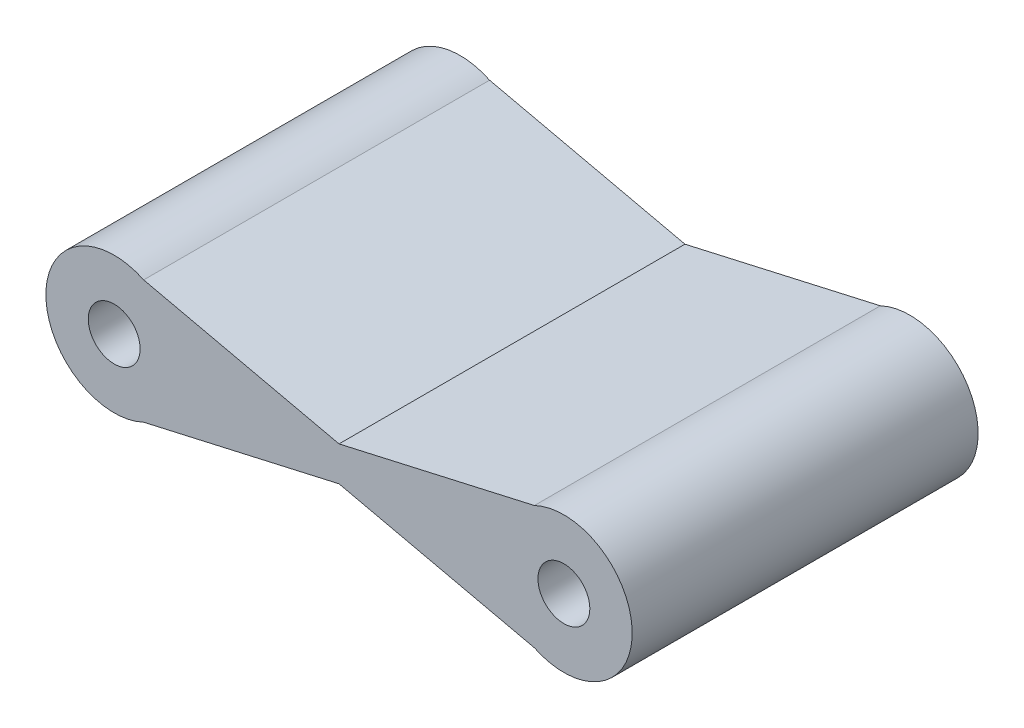
ISO-10303-21;
HEADER;
FILE_DESCRIPTION(('STEP AP214'),'2;1');
FILE_NAME('part.step','',(''),(''),'','','');
FILE_SCHEMA(('AUTOMOTIVE_DESIGN { 1 0 10303 214 1 1 1 1 }'));
ENDSEC;
DATA;
#1=APPLICATION_CONTEXT('core data for automotive mechanical design processes');
#2=APPLICATION_PROTOCOL_DEFINITION('international standard','automotive_design',2000,#1);
#3=PRODUCT_CONTEXT('',#1,'mechanical');
#4=PRODUCT('Part','Part','',(#3));
#5=PRODUCT_RELATED_PRODUCT_CATEGORY('part','',(#4));
#6=PRODUCT_DEFINITION_FORMATION('','',#4);
#7=PRODUCT_DEFINITION_CONTEXT('part definition',#1,'design');
#8=PRODUCT_DEFINITION('design','',#6,#7);
#9=PRODUCT_DEFINITION_SHAPE('','',#8);
#10=(LENGTH_UNIT() NAMED_UNIT(*) SI_UNIT(.MILLI.,.METRE.));
#11=(NAMED_UNIT(*) PLANE_ANGLE_UNIT() SI_UNIT($,.RADIAN.));
#12=(NAMED_UNIT(*) SI_UNIT($,.STERADIAN.) SOLID_ANGLE_UNIT());
#13=UNCERTAINTY_MEASURE_WITH_UNIT(LENGTH_MEASURE(1.E-05),#10,'distance_accuracy_value','');
#14=(GEOMETRIC_REPRESENTATION_CONTEXT(3) GLOBAL_UNCERTAINTY_ASSIGNED_CONTEXT((#13)) GLOBAL_UNIT_ASSIGNED_CONTEXT((#10,
#11,#12)) REPRESENTATION_CONTEXT('',''));
#15=CARTESIAN_POINT('',(0.,0.,0.));
#16=DIRECTION('',(0.,0.,1.));
#17=DIRECTION('',(1.,0.,0.));
#18=AXIS2_PLACEMENT_3D('',#15,#16,#17);
#19=CARTESIAN_POINT('',(0.318319944851648,1.40276585866828,10.));
#20=DIRECTION('',(-0.221296857654929,-0.975206491360704,0.));
#21=DIRECTION('',(0.975206491360704,-0.221296857654929,0.));
#22=AXIS2_PLACEMENT_3D('',#19,#20,#21);
#23=PLANE('',#22);
#24=DIRECTION('',(-0.975206491360704,0.221296857654929,0.));
#25=VECTOR('',#24,1.);
#26=CARTESIAN_POINT('',(0.318319944851648,1.40276585866828,0.));
#27=LINE('',#26,#25);
#28=CARTESIAN_POINT('',(12.1475499781939,-1.28155941812862,0.));
#29=VERTEX_POINT('',#28);
#30=CARTESIAN_POINT('',(6.5,0.,0.));
#31=VERTEX_POINT('',#30);
#32=EDGE_CURVE('E129',#29,#31,#27,.T.);
#33=ORIENTED_EDGE('',*,*,#32,.F.);
#34=DIRECTION('',(0.,0.,-1.));
#35=VECTOR('',#34,1.);
#36=CARTESIAN_POINT('',(12.1475499781939,-1.28155941812862,10.));
#37=LINE('',#36,#35);
#38=CARTESIAN_POINT('',(12.1475499781939,-1.28155941812862,10.));
#39=VERTEX_POINT('',#38);
#40=EDGE_CURVE('E11',#39,#29,#37,.T.);
#41=ORIENTED_EDGE('',*,*,#40,.F.);
#42=DIRECTION('',(-0.975206491360704,0.221296857654929,0.));
#43=VECTOR('',#42,1.);
#44=CARTESIAN_POINT('',(0.318319944851648,1.40276585866828,10.));
#45=LINE('',#44,#43);
#46=CARTESIAN_POINT('',(6.5,0.,10.));
#47=VERTEX_POINT('',#46);
#48=EDGE_CURVE('E189',#39,#47,#45,.T.);
#49=ORIENTED_EDGE('',*,*,#48,.T.);
#50=DIRECTION('',(0.,0.,-1.));
#51=VECTOR('',#50,1.);
#52=CARTESIAN_POINT('',(6.5,0.,10.));
#53=LINE('',#52,#51);
#54=EDGE_CURVE('E82',#47,#31,#53,.T.);
#55=ORIENTED_EDGE('',*,*,#54,.T.);
#56=EDGE_LOOP('',(#33,#41,#49,#55));
#57=FACE_BOUND('',#56,.T.);
#58=ADVANCED_FACE('F36',(#57),#23,.T.);
#59=CARTESIAN_POINT('',(13.,0.5,10.));
#60=DIRECTION('',(0.,0.,-1.));
#61=DIRECTION('',(-1.,0.,0.));
#62=AXIS2_PLACEMENT_3D('',#59,#60,#61);
#63=CYLINDRICAL_SURFACE('',#62,1.97499999999999);
#64=CARTESIAN_POINT('',(13.,0.5,0.));
#65=DIRECTION('',(0.,0.,1.));
#66=DIRECTION('',(1.,0.,0.));
#67=AXIS2_PLACEMENT_3D('',#64,#65,#66);
#68=CIRCLE('',#67,1.97499999999999);
#69=CARTESIAN_POINT('',(12.1475499781939,2.28155941812862,0.));
#70=VERTEX_POINT('',#69);
#71=EDGE_CURVE('E131',#29,#70,#68,.T.);
#72=ORIENTED_EDGE('',*,*,#71,.T.);
#73=DIRECTION('',(0.,0.,-1.));
#74=VECTOR('',#73,1.);
#75=CARTESIAN_POINT('',(12.1475499781939,2.28155941812862,10.));
#76=LINE('',#75,#74);
#77=CARTESIAN_POINT('',(12.1475499781939,2.28155941812862,10.));
#78=VERTEX_POINT('',#77);
#79=EDGE_CURVE('E45',#78,#70,#76,.T.);
#80=ORIENTED_EDGE('',*,*,#79,.F.);
#81=CARTESIAN_POINT('',(13.,0.5,10.));
#82=DIRECTION('',(0.,0.,1.));
#83=DIRECTION('',(1.,0.,0.));
#84=AXIS2_PLACEMENT_3D('',#81,#82,#83);
#85=CIRCLE('',#84,1.97499999999999);
#86=EDGE_CURVE('E118',#39,#78,#85,.T.);
#87=ORIENTED_EDGE('',*,*,#86,.F.);
#88=ORIENTED_EDGE('',*,*,#40,.T.);
#89=EDGE_LOOP('',(#72,#80,#87,#88));
#90=FACE_BOUND('',#89,.T.);
#91=ADVANCED_FACE('F153',(#90),#63,.T.);
#92=CARTESIAN_POINT('',(0.102509812748837,-0.45173815787623,10.));
#93=DIRECTION('',(-0.221296857654929,0.975206491360704,0.));
#94=DIRECTION('',(-0.975206491360704,-0.221296857654929,0.));
#95=AXIS2_PLACEMENT_3D('',#92,#93,#94);
#96=PLANE('',#95);
#97=DIRECTION('',(0.975206491360704,0.221296857654929,0.));
#98=VECTOR('',#97,1.);
#99=CARTESIAN_POINT('',(0.102509812748837,-0.45173815787623,0.));
#100=LINE('',#99,#98);
#101=CARTESIAN_POINT('',(6.5,0.999999999999999,0.));
#102=VERTEX_POINT('',#101);
#103=EDGE_CURVE('E134',#102,#70,#100,.T.);
#104=ORIENTED_EDGE('',*,*,#103,.F.);
#105=DIRECTION('',(0.,0.,-1.));
#106=VECTOR('',#105,1.);
#107=CARTESIAN_POINT('',(6.5,0.999999999999999,10.));
#108=LINE('',#107,#106);
#109=CARTESIAN_POINT('',(6.5,0.999999999999999,10.));
#110=VERTEX_POINT('',#109);
#111=EDGE_CURVE('E105',#110,#102,#108,.T.);
#112=ORIENTED_EDGE('',*,*,#111,.F.);
#113=DIRECTION('',(0.975206491360704,0.221296857654929,0.));
#114=VECTOR('',#113,1.);
#115=CARTESIAN_POINT('',(0.102509812748837,-0.45173815787623,10.));
#116=LINE('',#115,#114);
#117=EDGE_CURVE('E116',#110,#78,#116,.T.);
#118=ORIENTED_EDGE('',*,*,#117,.T.);
#119=ORIENTED_EDGE('',*,*,#79,.T.);
#120=EDGE_LOOP('',(#104,#112,#118,#119));
#121=FACE_BOUND('',#120,.T.);
#122=ADVANCED_FACE('F150',(#121),#96,.T.);
#123=CARTESIAN_POINT('',(0.534130076954461,2.35379355946033,10.));
#124=DIRECTION('',(0.221296857654929,0.975206491360704,0.));
#125=DIRECTION('',(-0.975206491360704,0.221296857654929,0.));
#126=AXIS2_PLACEMENT_3D('',#123,#124,#125);
#127=PLANE('',#126);
#128=DIRECTION('',(0.975206491360704,-0.221296857654929,0.));
#129=VECTOR('',#128,1.);
#130=CARTESIAN_POINT('',(0.534130076954461,2.35379355946033,0.));
#131=LINE('',#130,#129);
#132=CARTESIAN_POINT('',(0.852450021806109,2.28155941812861,0.));
#133=VERTEX_POINT('',#132);
#134=EDGE_CURVE('E102',#133,#102,#131,.T.);
#135=ORIENTED_EDGE('',*,*,#134,.F.);
#136=DIRECTION('',(0.,0.,-1.));
#137=VECTOR('',#136,1.);
#138=CARTESIAN_POINT('',(0.852450021806109,2.28155941812861,10.));
#139=LINE('',#138,#137);
#140=CARTESIAN_POINT('',(0.852450021806109,2.28155941812861,10.));
#141=VERTEX_POINT('',#140);
#142=EDGE_CURVE('E96',#141,#133,#139,.T.);
#143=ORIENTED_EDGE('',*,*,#142,.F.);
#144=DIRECTION('',(0.975206491360704,-0.221296857654929,0.));
#145=VECTOR('',#144,1.);
#146=CARTESIAN_POINT('',(0.534130076954461,2.35379355946033,10.));
#147=LINE('',#146,#145);
#148=EDGE_CURVE('E100',#141,#110,#147,.T.);
#149=ORIENTED_EDGE('',*,*,#148,.T.);
#150=ORIENTED_EDGE('',*,*,#111,.T.);
#151=EDGE_LOOP('',(#135,#143,#149,#150));
#152=FACE_BOUND('',#151,.T.);
#153=ADVANCED_FACE('F98',(#152),#127,.T.);
#154=CARTESIAN_POINT('',(0.,0.5,10.));
#155=DIRECTION('',(0.,0.,-1.));
#156=DIRECTION('',(-1.,0.,0.));
#157=AXIS2_PLACEMENT_3D('',#154,#155,#156);
#158=CYLINDRICAL_SURFACE('',#157,1.975);
#159=CARTESIAN_POINT('',(0.,0.5,0.));
#160=DIRECTION('',(0.,0.,1.));
#161=DIRECTION('',(1.,0.,0.));
#162=AXIS2_PLACEMENT_3D('',#159,#160,#161);
#163=CIRCLE('',#162,1.975);
#164=CARTESIAN_POINT('',(0.852450021806107,-1.28155941812861,0.));
#165=VERTEX_POINT('',#164);
#166=EDGE_CURVE('E138',#133,#165,#163,.T.);
#167=ORIENTED_EDGE('',*,*,#166,.T.);
#168=DIRECTION('',(0.,0.,-1.));
#169=VECTOR('',#168,1.);
#170=CARTESIAN_POINT('',(0.852450021806107,-1.28155941812861,10.));
#171=LINE('',#170,#169);
#172=CARTESIAN_POINT('',(0.852450021806107,-1.28155941812861,10.));
#173=VERTEX_POINT('',#172);
#174=EDGE_CURVE('E106',#173,#165,#171,.T.);
#175=ORIENTED_EDGE('',*,*,#174,.F.);
#176=CARTESIAN_POINT('',(0.,0.5,10.));
#177=DIRECTION('',(0.,0.,1.));
#178=DIRECTION('',(1.,0.,0.));
#179=AXIS2_PLACEMENT_3D('',#176,#177,#178);
#180=CIRCLE('',#179,1.975);
#181=EDGE_CURVE('E109',#141,#173,#180,.T.);
#182=ORIENTED_EDGE('',*,*,#181,.F.);
#183=ORIENTED_EDGE('',*,*,#142,.T.);
#184=EDGE_LOOP('',(#167,#175,#182,#183));
#185=FACE_BOUND('',#184,.T.);
#186=ADVANCED_FACE('F110',(#185),#158,.T.);
#187=CARTESIAN_POINT('',(0.318319944851648,-1.40276585866828,10.));
#188=DIRECTION('',(-0.221296857654929,0.975206491360704,0.));
#189=DIRECTION('',(-0.975206491360704,-0.221296857654929,0.));
#190=AXIS2_PLACEMENT_3D('',#187,#188,#189);
#191=PLANE('',#190);
#192=DIRECTION('',(0.975206491360704,0.221296857654929,0.));
#193=VECTOR('',#192,1.);
#194=CARTESIAN_POINT('',(0.318319944851648,-1.40276585866828,0.));
#195=LINE('',#194,#193);
#196=EDGE_CURVE('E75',#165,#31,#195,.T.);
#197=ORIENTED_EDGE('',*,*,#196,.T.);
#198=ORIENTED_EDGE('',*,*,#54,.F.);
#199=DIRECTION('',(0.975206491360704,0.221296857654929,0.));
#200=VECTOR('',#199,1.);
#201=CARTESIAN_POINT('',(0.318319944851648,-1.40276585866828,10.));
#202=LINE('',#201,#200);
#203=EDGE_CURVE('E53',#173,#47,#202,.T.);
#204=ORIENTED_EDGE('',*,*,#203,.F.);
#205=ORIENTED_EDGE('',*,*,#174,.T.);
#206=EDGE_LOOP('',(#197,#198,#204,#205));
#207=FACE_BOUND('',#206,.T.);
#208=ADVANCED_FACE('F171',(#207),#191,.F.);
#209=CARTESIAN_POINT('',(13.,0.5,10.));
#210=DIRECTION('',(0.,0.,-1.));
#211=DIRECTION('',(-1.,0.,0.));
#212=AXIS2_PLACEMENT_3D('',#209,#210,#211);
#213=CYLINDRICAL_SURFACE('',#212,0.750000000000002);
#214=CARTESIAN_POINT('',(13.,0.5,10.));
#215=DIRECTION('',(0.,0.,1.));
#216=DIRECTION('',(1.,0.,0.));
#217=AXIS2_PLACEMENT_3D('',#214,#215,#216);
#218=CIRCLE('',#217,0.750000000000002);
#219=CARTESIAN_POINT('',(13.75,0.5,10.));
#220=VERTEX_POINT('',#219);
#221=EDGE_CURVE('E144',#220,#220,#218,.T.);
#222=ORIENTED_EDGE('',*,*,#221,.T.);
#223=EDGE_LOOP('',(#222));
#224=FACE_BOUND('',#223,.T.);
#225=CARTESIAN_POINT('',(13.,0.5,0.));
#226=DIRECTION('',(0.,0.,1.));
#227=DIRECTION('',(1.,0.,0.));
#228=AXIS2_PLACEMENT_3D('',#225,#226,#227);
#229=CIRCLE('',#228,0.750000000000002);
#230=CARTESIAN_POINT('',(13.75,0.5,0.));
#231=VERTEX_POINT('',#230);
#232=EDGE_CURVE('E126',#231,#231,#229,.T.);
#233=ORIENTED_EDGE('',*,*,#232,.F.);
#234=EDGE_LOOP('',(#233));
#235=FACE_BOUND('',#234,.T.);
#236=ADVANCED_FACE('F38',(#224,#235),#213,.F.);
#237=CARTESIAN_POINT('',(0.,0.5,10.));
#238=DIRECTION('',(0.,0.,-1.));
#239=DIRECTION('',(-1.,0.,0.));
#240=AXIS2_PLACEMENT_3D('',#237,#238,#239);
#241=CYLINDRICAL_SURFACE('',#240,0.75);
#242=CARTESIAN_POINT('',(0.,0.5,10.));
#243=DIRECTION('',(0.,0.,1.));
#244=DIRECTION('',(1.,0.,0.));
#245=AXIS2_PLACEMENT_3D('',#242,#243,#244);
#246=CIRCLE('',#245,0.75);
#247=CARTESIAN_POINT('',(0.75,0.5,10.));
#248=VERTEX_POINT('',#247);
#249=EDGE_CURVE('E123',#248,#248,#246,.T.);
#250=ORIENTED_EDGE('',*,*,#249,.T.);
#251=EDGE_LOOP('',(#250));
#252=FACE_BOUND('',#251,.T.);
#253=CARTESIAN_POINT('',(0.,0.5,0.));
#254=DIRECTION('',(0.,0.,1.));
#255=DIRECTION('',(1.,0.,0.));
#256=AXIS2_PLACEMENT_3D('',#253,#254,#255);
#257=CIRCLE('',#256,0.75);
#258=CARTESIAN_POINT('',(0.75,0.5,0.));
#259=VERTEX_POINT('',#258);
#260=EDGE_CURVE('E141',#259,#259,#257,.T.);
#261=ORIENTED_EDGE('',*,*,#260,.F.);
#262=EDGE_LOOP('',(#261));
#263=FACE_BOUND('',#262,.T.);
#264=ADVANCED_FACE('F161',(#252,#263),#241,.F.);
#265=CARTESIAN_POINT('',(0.,0.,10.));
#266=DIRECTION('',(0.,0.,1.));
#267=DIRECTION('',(1.,0.,0.));
#268=AXIS2_PLACEMENT_3D('',#265,#266,#267);
#269=PLANE('',#268);
#270=ORIENTED_EDGE('',*,*,#221,.F.);
#271=EDGE_LOOP('',(#270));
#272=FACE_BOUND('',#271,.T.);
#273=ORIENTED_EDGE('',*,*,#48,.F.);
#274=ORIENTED_EDGE('',*,*,#86,.T.);
#275=ORIENTED_EDGE('',*,*,#117,.F.);
#276=ORIENTED_EDGE('',*,*,#148,.F.);
#277=ORIENTED_EDGE('',*,*,#181,.T.);
#278=ORIENTED_EDGE('',*,*,#203,.T.);
#279=EDGE_LOOP('',(#273,#274,#275,#276,#277,#278));
#280=FACE_BOUND('',#279,.T.);
#281=ORIENTED_EDGE('',*,*,#249,.F.);
#282=EDGE_LOOP('',(#281));
#283=FACE_BOUND('',#282,.T.);
#284=ADVANCED_FACE('F113',(#272,#280,#283),#269,.T.);
#285=CARTESIAN_POINT('',(0.,0.,0.));
#286=DIRECTION('',(0.,0.,1.));
#287=DIRECTION('',(1.,0.,0.));
#288=AXIS2_PLACEMENT_3D('',#285,#286,#287);
#289=PLANE('',#288);
#290=ORIENTED_EDGE('',*,*,#232,.T.);
#291=EDGE_LOOP('',(#290));
#292=FACE_BOUND('',#291,.T.);
#293=ORIENTED_EDGE('',*,*,#32,.T.);
#294=ORIENTED_EDGE('',*,*,#196,.F.);
#295=ORIENTED_EDGE('',*,*,#166,.F.);
#296=ORIENTED_EDGE('',*,*,#134,.T.);
#297=ORIENTED_EDGE('',*,*,#103,.T.);
#298=ORIENTED_EDGE('',*,*,#71,.F.);
#299=EDGE_LOOP('',(#293,#294,#295,#296,#297,#298));
#300=FACE_BOUND('',#299,.T.);
#301=ORIENTED_EDGE('',*,*,#260,.T.);
#302=EDGE_LOOP('',(#301));
#303=FACE_BOUND('',#302,.T.);
#304=ADVANCED_FACE('F154',(#292,#300,#303),#289,.F.);
#305=CLOSED_SHELL('',(#58,#91,#122,#153,#186,#208,#236,#264,#284,#304));
#306=MANIFOLD_SOLID_BREP('B2',#305);
#307=ADVANCED_BREP_SHAPE_REPRESENTATION('',(#18,#306),#14);
#308=SHAPE_DEFINITION_REPRESENTATION(#9,#307);
ENDSEC;
END-ISO-10303-21;
